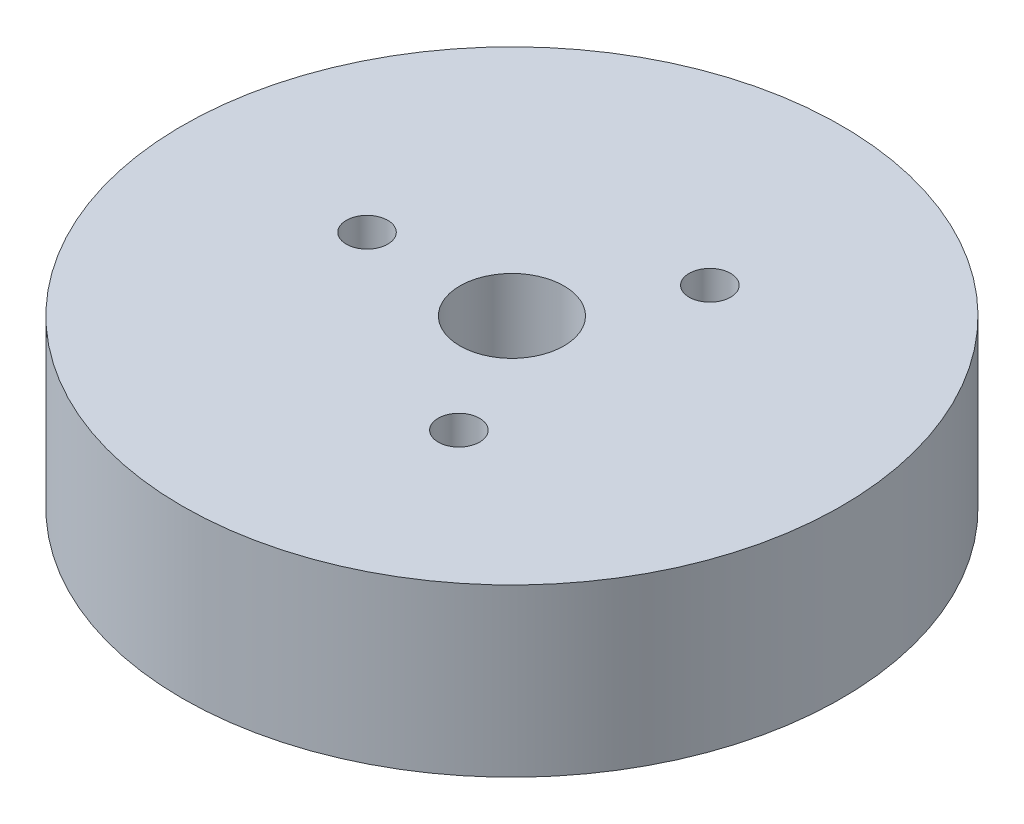
ISO-10303-21;
HEADER;
FILE_DESCRIPTION(('STEP AP214'),'2;1');
FILE_NAME('part.step','',(''),(''),'','','');
FILE_SCHEMA(('AUTOMOTIVE_DESIGN { 1 0 10303 214 1 1 1 1 }'));
ENDSEC;
DATA;
#1=APPLICATION_CONTEXT('core data for automotive mechanical design processes');
#2=APPLICATION_PROTOCOL_DEFINITION('international standard','automotive_design',2000,#1);
#3=PRODUCT_CONTEXT('',#1,'mechanical');
#4=PRODUCT('Part','Part','',(#3));
#5=PRODUCT_RELATED_PRODUCT_CATEGORY('part','',(#4));
#6=PRODUCT_DEFINITION_FORMATION('','',#4);
#7=PRODUCT_DEFINITION_CONTEXT('part definition',#1,'design');
#8=PRODUCT_DEFINITION('design','',#6,#7);
#9=PRODUCT_DEFINITION_SHAPE('','',#8);
#10=(LENGTH_UNIT() NAMED_UNIT(*) SI_UNIT(.MILLI.,.METRE.));
#11=(NAMED_UNIT(*) PLANE_ANGLE_UNIT() SI_UNIT($,.RADIAN.));
#12=(NAMED_UNIT(*) SI_UNIT($,.STERADIAN.) SOLID_ANGLE_UNIT());
#13=UNCERTAINTY_MEASURE_WITH_UNIT(LENGTH_MEASURE(1.E-05),#10,'distance_accuracy_value','');
#14=(GEOMETRIC_REPRESENTATION_CONTEXT(3) GLOBAL_UNCERTAINTY_ASSIGNED_CONTEXT((#13)) GLOBAL_UNIT_ASSIGNED_CONTEXT((#10,
#11,#12)) REPRESENTATION_CONTEXT('',''));
#15=CARTESIAN_POINT('',(0.,0.,0.));
#16=DIRECTION('',(0.,0.,1.));
#17=DIRECTION('',(1.,0.,0.));
#18=AXIS2_PLACEMENT_3D('',#15,#16,#17);
#19=CARTESIAN_POINT('',(0.,24.,0.));
#20=DIRECTION('',(0.,-1.,0.));
#21=DIRECTION('',(0.,0.,-1.));
#22=AXIS2_PLACEMENT_3D('',#19,#20,#21);
#23=CYLINDRICAL_SURFACE('',#22,47.5);
#24=CARTESIAN_POINT('',(0.,24.,0.));
#25=DIRECTION('',(0.,1.,0.));
#26=DIRECTION('',(0.,0.,1.));
#27=AXIS2_PLACEMENT_3D('',#24,#25,#26);
#28=CIRCLE('',#27,47.5);
#29=CARTESIAN_POINT('',(0.,24.,47.5));
#30=VERTEX_POINT('',#29);
#31=EDGE_CURVE('E10',#30,#30,#28,.T.);
#32=ORIENTED_EDGE('',*,*,#31,.F.);
#33=EDGE_LOOP('',(#32));
#34=FACE_BOUND('',#33,.T.);
#35=CARTESIAN_POINT('',(0.,0.,0.));
#36=DIRECTION('',(0.,1.,0.));
#37=DIRECTION('',(0.,0.,1.));
#38=AXIS2_PLACEMENT_3D('',#35,#36,#37);
#39=CIRCLE('',#38,47.5);
#40=CARTESIAN_POINT('',(0.,0.,47.5));
#41=VERTEX_POINT('',#40);
#42=EDGE_CURVE('E37',#41,#41,#39,.T.);
#43=ORIENTED_EDGE('',*,*,#42,.T.);
#44=EDGE_LOOP('',(#43));
#45=FACE_BOUND('',#44,.T.);
#46=ADVANCED_FACE('F40',(#34,#45),#23,.T.);
#47=CARTESIAN_POINT('',(0.,24.,0.));
#48=DIRECTION('',(0.,1.,0.));
#49=DIRECTION('',(0.,0.,1.));
#50=AXIS2_PLACEMENT_3D('',#47,#48,#49);
#51=PLANE('',#50);
#52=CARTESIAN_POINT('',(10.4421053605852,24.,18.0862570225206));
#53=DIRECTION('',(0.,1.,0.));
#54=DIRECTION('',(0.866025403784436,0.,-0.500000000000004));
#55=AXIS2_PLACEMENT_3D('',#52,#53,#54);
#56=CIRCLE('',#55,2.98645779303566);
#57=CARTESIAN_POINT('',(13.028453676684,24.,16.5930281260028));
#58=VERTEX_POINT('',#57);
#59=EDGE_CURVE('E70',#58,#58,#56,.T.);
#60=ORIENTED_EDGE('',*,*,#59,.F.);
#61=EDGE_LOOP('',(#60));
#62=FACE_BOUND('',#61,.T.);
#63=CARTESIAN_POINT('',(10.4421053605849,24.,-18.0862570225208));
#64=DIRECTION('',(0.,1.,0.));
#65=DIRECTION('',(-0.866025403784443,0.,-0.499999999999992));
#66=AXIS2_PLACEMENT_3D('',#63,#64,#65);
#67=CIRCLE('',#66,2.98645779303566);
#68=CARTESIAN_POINT('',(7.855757044486,24.,-19.5794859190386));
#69=VERTEX_POINT('',#68);
#70=EDGE_CURVE('E61',#69,#69,#67,.T.);
#71=ORIENTED_EDGE('',*,*,#70,.F.);
#72=EDGE_LOOP('',(#71));
#73=FACE_BOUND('',#72,.T.);
#74=CARTESIAN_POINT('',(-20.8842107211701,24.,0.));
#75=DIRECTION('',(0.,1.,0.));
#76=DIRECTION('',(0.,0.,1.));
#77=AXIS2_PLACEMENT_3D('',#74,#75,#76);
#78=CIRCLE('',#77,2.98645779303566);
#79=CARTESIAN_POINT('',(-20.8842107211701,24.,2.98645779303566));
#80=VERTEX_POINT('',#79);
#81=EDGE_CURVE('E54',#80,#80,#78,.T.);
#82=ORIENTED_EDGE('',*,*,#81,.F.);
#83=EDGE_LOOP('',(#82));
#84=FACE_BOUND('',#83,.T.);
#85=CARTESIAN_POINT('',(0.,24.,0.));
#86=DIRECTION('',(0.,1.,0.));
#87=DIRECTION('',(0.,0.,1.));
#88=AXIS2_PLACEMENT_3D('',#85,#86,#87);
#89=CIRCLE('',#88,7.5);
#90=CARTESIAN_POINT('',(0.,24.,7.5));
#91=VERTEX_POINT('',#90);
#92=EDGE_CURVE('E50',#91,#91,#89,.T.);
#93=ORIENTED_EDGE('',*,*,#92,.F.);
#94=EDGE_LOOP('',(#93));
#95=FACE_BOUND('',#94,.T.);
#96=ORIENTED_EDGE('',*,*,#31,.T.);
#97=EDGE_LOOP('',(#96));
#98=FACE_BOUND('',#97,.T.);
#99=ADVANCED_FACE('F85',(#62,#73,#84,#95,#98),#51,.T.);
#100=CARTESIAN_POINT('',(0.,0.,0.));
#101=DIRECTION('',(0.,1.,0.));
#102=DIRECTION('',(0.,0.,1.));
#103=AXIS2_PLACEMENT_3D('',#100,#101,#102);
#104=PLANE('',#103);
#105=CARTESIAN_POINT('',(0.,0.,0.));
#106=DIRECTION('',(0.,1.,0.));
#107=DIRECTION('',(0.,0.,1.));
#108=AXIS2_PLACEMENT_3D('',#105,#106,#107);
#109=CIRCLE('',#108,7.5);
#110=CARTESIAN_POINT('',(0.,0.,7.5));
#111=VERTEX_POINT('',#110);
#112=EDGE_CURVE('E47',#111,#111,#109,.T.);
#113=ORIENTED_EDGE('',*,*,#112,.T.);
#114=EDGE_LOOP('',(#113));
#115=FACE_BOUND('',#114,.T.);
#116=ORIENTED_EDGE('',*,*,#42,.F.);
#117=EDGE_LOOP('',(#116));
#118=FACE_BOUND('',#117,.T.);
#119=ADVANCED_FACE('F84',(#115,#118),#104,.F.);
#120=CARTESIAN_POINT('',(0.,24.,0.));
#121=DIRECTION('',(0.,-1.,0.));
#122=DIRECTION('',(0.,0.,-1.));
#123=AXIS2_PLACEMENT_3D('',#120,#121,#122);
#124=CYLINDRICAL_SURFACE('',#123,7.5);
#125=ORIENTED_EDGE('',*,*,#92,.T.);
#126=EDGE_LOOP('',(#125));
#127=FACE_BOUND('',#126,.T.);
#128=ORIENTED_EDGE('',*,*,#112,.F.);
#129=EDGE_LOOP('',(#128));
#130=FACE_BOUND('',#129,.T.);
#131=ADVANCED_FACE('F91',(#127,#130),#124,.F.);
#132=CARTESIAN_POINT('',(-20.8842107211701,4.67110662584694,0.));
#133=DIRECTION('',(0.,1.,0.));
#134=DIRECTION('',(0.,0.,1.));
#135=AXIS2_PLACEMENT_3D('',#132,#133,#134);
#136=CYLINDRICAL_SURFACE('',#135,2.98645779303566);
#137=CARTESIAN_POINT('',(-20.8842107211701,4.67110662584694,0.));
#138=DIRECTION('',(0.,1.,0.));
#139=DIRECTION('',(0.,0.,1.));
#140=AXIS2_PLACEMENT_3D('',#137,#138,#139);
#141=CIRCLE('',#140,2.98645779303566);
#142=CARTESIAN_POINT('',(-20.8842107211701,4.67110662584694,2.98645779303566));
#143=VERTEX_POINT('',#142);
#144=EDGE_CURVE('E55',#143,#143,#141,.T.);
#145=ORIENTED_EDGE('',*,*,#144,.F.);
#146=EDGE_LOOP('',(#145));
#147=FACE_BOUND('',#146,.T.);
#148=ORIENTED_EDGE('',*,*,#81,.T.);
#149=EDGE_LOOP('',(#148));
#150=FACE_BOUND('',#149,.T.);
#151=ADVANCED_FACE('F96',(#147,#150),#136,.F.);
#152=CARTESIAN_POINT('',(-20.8842107211701,4.67110662584694,0.));
#153=DIRECTION('',(0.,1.,0.));
#154=DIRECTION('',(0.,0.,1.));
#155=AXIS2_PLACEMENT_3D('',#152,#153,#154);
#156=PLANE('',#155);
#157=ORIENTED_EDGE('',*,*,#144,.T.);
#158=EDGE_LOOP('',(#157));
#159=FACE_BOUND('',#158,.T.);
#160=ADVANCED_FACE('F127',(#159),#156,.T.);
#161=CARTESIAN_POINT('',(10.4421053605849,4.67110662584694,-18.0862570225208));
#162=DIRECTION('',(0.,1.,0.));
#163=DIRECTION('',(0.,0.,1.));
#164=AXIS2_PLACEMENT_3D('',#161,#162,#163);
#165=CYLINDRICAL_SURFACE('',#164,2.98645779303566);
#166=CARTESIAN_POINT('',(10.4421053605849,4.67110662584694,-18.0862570225208));
#167=DIRECTION('',(0.,1.,0.));
#168=DIRECTION('',(-0.866025403784443,0.,-0.499999999999992));
#169=AXIS2_PLACEMENT_3D('',#166,#167,#168);
#170=CIRCLE('',#169,2.98645779303566);
#171=CARTESIAN_POINT('',(7.855757044486,4.67110662584694,-19.5794859190386));
#172=VERTEX_POINT('',#171);
#173=EDGE_CURVE('E63',#172,#172,#170,.T.);
#174=ORIENTED_EDGE('',*,*,#173,.F.);
#175=EDGE_LOOP('',(#174));
#176=FACE_BOUND('',#175,.T.);
#177=ORIENTED_EDGE('',*,*,#70,.T.);
#178=EDGE_LOOP('',(#177));
#179=FACE_BOUND('',#178,.T.);
#180=ADVANCED_FACE('F133',(#176,#179),#165,.F.);
#181=CARTESIAN_POINT('',(10.4421053605849,4.67110662584694,-18.0862570225208));
#182=DIRECTION('',(0.,1.,0.));
#183=DIRECTION('',(-0.866025403784443,0.,-0.499999999999992));
#184=AXIS2_PLACEMENT_3D('',#181,#182,#183);
#185=PLANE('',#184);
#186=ORIENTED_EDGE('',*,*,#173,.T.);
#187=EDGE_LOOP('',(#186));
#188=FACE_BOUND('',#187,.T.);
#189=ADVANCED_FACE('F77',(#188),#185,.T.);
#190=CARTESIAN_POINT('',(10.4421053605852,4.67110662584694,18.0862570225206));
#191=DIRECTION('',(0.,1.,0.));
#192=DIRECTION('',(0.,0.,1.));
#193=AXIS2_PLACEMENT_3D('',#190,#191,#192);
#194=CYLINDRICAL_SURFACE('',#193,2.98645779303566);
#195=CARTESIAN_POINT('',(10.4421053605852,4.67110662584694,18.0862570225206));
#196=DIRECTION('',(0.,1.,0.));
#197=DIRECTION('',(0.866025403784436,0.,-0.500000000000004));
#198=AXIS2_PLACEMENT_3D('',#195,#196,#197);
#199=CIRCLE('',#198,2.98645779303566);
#200=CARTESIAN_POINT('',(13.028453676684,4.67110662584694,16.5930281260028));
#201=VERTEX_POINT('',#200);
#202=EDGE_CURVE('E59',#201,#201,#199,.T.);
#203=ORIENTED_EDGE('',*,*,#202,.F.);
#204=EDGE_LOOP('',(#203));
#205=FACE_BOUND('',#204,.T.);
#206=ORIENTED_EDGE('',*,*,#59,.T.);
#207=EDGE_LOOP('',(#206));
#208=FACE_BOUND('',#207,.T.);
#209=ADVANCED_FACE('F73',(#205,#208),#194,.F.);
#210=CARTESIAN_POINT('',(10.4421053605852,4.67110662584694,18.0862570225206));
#211=DIRECTION('',(0.,1.,0.));
#212=DIRECTION('',(0.866025403784436,0.,-0.500000000000004));
#213=AXIS2_PLACEMENT_3D('',#210,#211,#212);
#214=PLANE('',#213);
#215=ORIENTED_EDGE('',*,*,#202,.T.);
#216=EDGE_LOOP('',(#215));
#217=FACE_BOUND('',#216,.T.);
#218=ADVANCED_FACE('F71',(#217),#214,.T.);
#219=CLOSED_SHELL('',(#46,#99,#119,#131,#151,#160,#180,#189,#209,#218));
#220=MANIFOLD_SOLID_BREP('B2',#219);
#221=ADVANCED_BREP_SHAPE_REPRESENTATION('',(#18,#220),#14);
#222=SHAPE_DEFINITION_REPRESENTATION(#9,#221);
ENDSEC;
END-ISO-10303-21;
